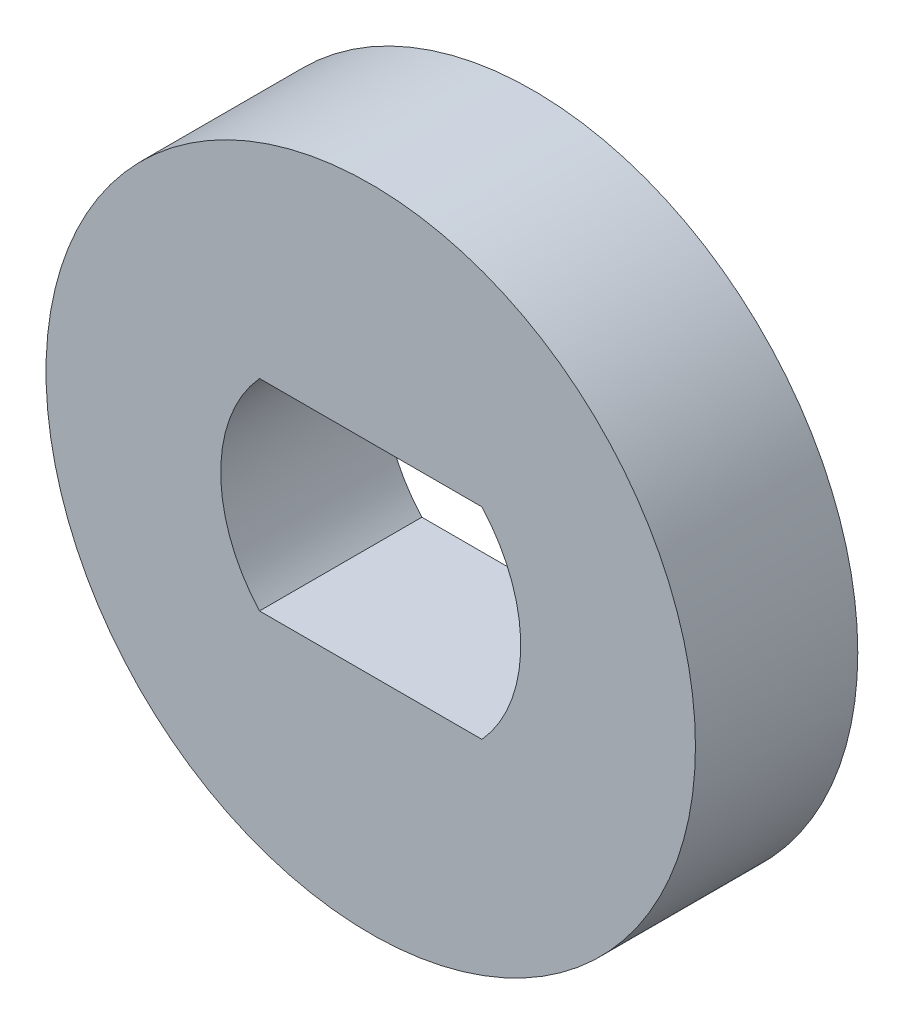
ISO-10303-21;
HEADER;
FILE_DESCRIPTION(('STEP AP214'),'2;1');
FILE_NAME('part.step','',(''),(''),'','','');
FILE_SCHEMA(('AUTOMOTIVE_DESIGN { 1 0 10303 214 1 1 1 1 }'));
ENDSEC;
DATA;
#1=APPLICATION_CONTEXT('core data for automotive mechanical design processes');
#2=APPLICATION_PROTOCOL_DEFINITION('international standard','automotive_design',2000,#1);
#3=PRODUCT_CONTEXT('',#1,'mechanical');
#4=PRODUCT('Part','Part','',(#3));
#5=PRODUCT_RELATED_PRODUCT_CATEGORY('part','',(#4));
#6=PRODUCT_DEFINITION_FORMATION('','',#4);
#7=PRODUCT_DEFINITION_CONTEXT('part definition',#1,'design');
#8=PRODUCT_DEFINITION('design','',#6,#7);
#9=PRODUCT_DEFINITION_SHAPE('','',#8);
#10=(LENGTH_UNIT() NAMED_UNIT(*) SI_UNIT(.MILLI.,.METRE.));
#11=(NAMED_UNIT(*) PLANE_ANGLE_UNIT() SI_UNIT($,.RADIAN.));
#12=(NAMED_UNIT(*) SI_UNIT($,.STERADIAN.) SOLID_ANGLE_UNIT());
#13=UNCERTAINTY_MEASURE_WITH_UNIT(LENGTH_MEASURE(1.E-05),#10,'distance_accuracy_value','');
#14=(GEOMETRIC_REPRESENTATION_CONTEXT(3) GLOBAL_UNCERTAINTY_ASSIGNED_CONTEXT((#13)) GLOBAL_UNIT_ASSIGNED_CONTEXT((#10,
#11,#12)) REPRESENTATION_CONTEXT('',''));
#15=CARTESIAN_POINT('',(0.,0.,0.));
#16=DIRECTION('',(0.,0.,1.));
#17=DIRECTION('',(1.,0.,0.));
#18=AXIS2_PLACEMENT_3D('',#15,#16,#17);
#19=CARTESIAN_POINT('',(0.,0.,3.175));
#20=DIRECTION('',(0.,0.,-1.));
#21=DIRECTION('',(-1.,0.,0.));
#22=AXIS2_PLACEMENT_3D('',#19,#20,#21);
#23=CYLINDRICAL_SURFACE('',#22,2.9337);
#24=CARTESIAN_POINT('',(0.,0.,0.));
#25=DIRECTION('',(0.,0.,1.));
#26=DIRECTION('',(1.,0.,0.));
#27=AXIS2_PLACEMENT_3D('',#24,#25,#26);
#28=CIRCLE('',#27,2.9337);
#29=CARTESIAN_POINT('',(-2.17522491710627,1.9685,0.));
#30=VERTEX_POINT('',#29);
#31=CARTESIAN_POINT('',(-2.17522491710627,-1.9685,0.));
#32=VERTEX_POINT('',#31);
#33=EDGE_CURVE('E102',#30,#32,#28,.T.);
#34=ORIENTED_EDGE('',*,*,#33,.F.);
#35=DIRECTION('',(0.,0.,-1.));
#36=VECTOR('',#35,1.);
#37=CARTESIAN_POINT('',(-2.17522491710627,1.9685,3.175));
#38=LINE('',#37,#36);
#39=CARTESIAN_POINT('',(-2.17522491710627,1.9685,3.175));
#40=VERTEX_POINT('',#39);
#41=EDGE_CURVE('E11',#40,#30,#38,.T.);
#42=ORIENTED_EDGE('',*,*,#41,.F.);
#43=CARTESIAN_POINT('',(0.,0.,3.175));
#44=DIRECTION('',(0.,0.,1.));
#45=DIRECTION('',(1.,0.,0.));
#46=AXIS2_PLACEMENT_3D('',#43,#44,#45);
#47=CIRCLE('',#46,2.9337);
#48=CARTESIAN_POINT('',(-2.17522491710627,-1.9685,3.175));
#49=VERTEX_POINT('',#48);
#50=EDGE_CURVE('E84',#40,#49,#47,.T.);
#51=ORIENTED_EDGE('',*,*,#50,.T.);
#52=DIRECTION('',(0.,0.,-1.));
#53=VECTOR('',#52,1.);
#54=CARTESIAN_POINT('',(-2.17522491710627,-1.9685,3.175));
#55=LINE('',#54,#53);
#56=EDGE_CURVE('E51',#49,#32,#55,.T.);
#57=ORIENTED_EDGE('',*,*,#56,.T.);
#58=EDGE_LOOP('',(#34,#42,#51,#57));
#59=FACE_BOUND('',#58,.T.);
#60=ADVANCED_FACE('F35',(#59),#23,.F.);
#61=CARTESIAN_POINT('',(0.,1.9685,3.175));
#62=DIRECTION('',(0.,1.,0.));
#63=DIRECTION('',(0.,0.,1.));
#64=AXIS2_PLACEMENT_3D('',#61,#62,#63);
#65=PLANE('',#64);
#66=DIRECTION('',(1.,0.,0.));
#67=VECTOR('',#66,1.);
#68=CARTESIAN_POINT('',(0.,1.9685,0.));
#69=LINE('',#68,#67);
#70=CARTESIAN_POINT('',(2.17522491710627,1.9685,0.));
#71=VERTEX_POINT('',#70);
#72=EDGE_CURVE('E90',#30,#71,#69,.T.);
#73=ORIENTED_EDGE('',*,*,#72,.T.);
#74=DIRECTION('',(0.,0.,-1.));
#75=VECTOR('',#74,1.);
#76=CARTESIAN_POINT('',(2.17522491710627,1.9685,3.175));
#77=LINE('',#76,#75);
#78=CARTESIAN_POINT('',(2.17522491710627,1.9685,3.175));
#79=VERTEX_POINT('',#78);
#80=EDGE_CURVE('E43',#79,#71,#77,.T.);
#81=ORIENTED_EDGE('',*,*,#80,.F.);
#82=DIRECTION('',(1.,0.,0.));
#83=VECTOR('',#82,1.);
#84=CARTESIAN_POINT('',(0.,1.9685,3.175));
#85=LINE('',#84,#83);
#86=EDGE_CURVE('E77',#40,#79,#85,.T.);
#87=ORIENTED_EDGE('',*,*,#86,.F.);
#88=ORIENTED_EDGE('',*,*,#41,.T.);
#89=EDGE_LOOP('',(#73,#81,#87,#88));
#90=FACE_BOUND('',#89,.T.);
#91=ADVANCED_FACE('F88',(#90),#65,.F.);
#92=CARTESIAN_POINT('',(0.,0.,3.175));
#93=DIRECTION('',(0.,0.,-1.));
#94=DIRECTION('',(-1.,0.,0.));
#95=AXIS2_PLACEMENT_3D('',#92,#93,#94);
#96=CYLINDRICAL_SURFACE('',#95,2.9337);
#97=CARTESIAN_POINT('',(0.,0.,0.));
#98=DIRECTION('',(0.,0.,1.));
#99=DIRECTION('',(1.,0.,0.));
#100=AXIS2_PLACEMENT_3D('',#97,#98,#99);
#101=CIRCLE('',#100,2.9337);
#102=CARTESIAN_POINT('',(2.17522491710627,-1.9685,0.));
#103=VERTEX_POINT('',#102);
#104=EDGE_CURVE('E105',#103,#71,#101,.T.);
#105=ORIENTED_EDGE('',*,*,#104,.F.);
#106=DIRECTION('',(0.,0.,-1.));
#107=VECTOR('',#106,1.);
#108=CARTESIAN_POINT('',(2.17522491710627,-1.9685,3.175));
#109=LINE('',#108,#107);
#110=CARTESIAN_POINT('',(2.17522491710627,-1.9685,3.175));
#111=VERTEX_POINT('',#110);
#112=EDGE_CURVE('E64',#111,#103,#109,.T.);
#113=ORIENTED_EDGE('',*,*,#112,.F.);
#114=CARTESIAN_POINT('',(0.,0.,3.175));
#115=DIRECTION('',(0.,0.,1.));
#116=DIRECTION('',(1.,0.,0.));
#117=AXIS2_PLACEMENT_3D('',#114,#115,#116);
#118=CIRCLE('',#117,2.9337);
#119=EDGE_CURVE('E83',#111,#79,#118,.T.);
#120=ORIENTED_EDGE('',*,*,#119,.T.);
#121=ORIENTED_EDGE('',*,*,#80,.T.);
#122=EDGE_LOOP('',(#105,#113,#120,#121));
#123=FACE_BOUND('',#122,.T.);
#124=ADVANCED_FACE('F93',(#123),#96,.F.);
#125=CARTESIAN_POINT('',(0.,-1.9685,3.175));
#126=DIRECTION('',(0.,1.,0.));
#127=DIRECTION('',(0.,0.,1.));
#128=AXIS2_PLACEMENT_3D('',#125,#126,#127);
#129=PLANE('',#128);
#130=DIRECTION('',(1.,0.,0.));
#131=VECTOR('',#130,1.);
#132=CARTESIAN_POINT('',(0.,-1.9685,0.));
#133=LINE('',#132,#131);
#134=EDGE_CURVE('E107',#32,#103,#133,.T.);
#135=ORIENTED_EDGE('',*,*,#134,.F.);
#136=ORIENTED_EDGE('',*,*,#56,.F.);
#137=DIRECTION('',(1.,0.,0.));
#138=VECTOR('',#137,1.);
#139=CARTESIAN_POINT('',(0.,-1.9685,3.175));
#140=LINE('',#139,#138);
#141=EDGE_CURVE('E94',#49,#111,#140,.T.);
#142=ORIENTED_EDGE('',*,*,#141,.T.);
#143=ORIENTED_EDGE('',*,*,#112,.T.);
#144=EDGE_LOOP('',(#135,#136,#142,#143));
#145=FACE_BOUND('',#144,.T.);
#146=ADVANCED_FACE('F116',(#145),#129,.T.);
#147=CARTESIAN_POINT('',(0.,0.,3.175));
#148=DIRECTION('',(0.,0.,-1.));
#149=DIRECTION('',(-1.,0.,0.));
#150=AXIS2_PLACEMENT_3D('',#147,#148,#149);
#151=CYLINDRICAL_SURFACE('',#150,6.35);
#152=CARTESIAN_POINT('',(0.,0.,3.175));
#153=DIRECTION('',(0.,0.,1.));
#154=DIRECTION('',(1.,0.,0.));
#155=AXIS2_PLACEMENT_3D('',#152,#153,#154);
#156=CIRCLE('',#155,6.35);
#157=CARTESIAN_POINT('',(6.35,0.,3.175));
#158=VERTEX_POINT('',#157);
#159=EDGE_CURVE('E96',#158,#158,#156,.T.);
#160=ORIENTED_EDGE('',*,*,#159,.F.);
#161=EDGE_LOOP('',(#160));
#162=FACE_BOUND('',#161,.T.);
#163=CARTESIAN_POINT('',(0.,0.,0.));
#164=DIRECTION('',(0.,0.,1.));
#165=DIRECTION('',(1.,0.,0.));
#166=AXIS2_PLACEMENT_3D('',#163,#164,#165);
#167=CIRCLE('',#166,6.35);
#168=CARTESIAN_POINT('',(6.35,0.,0.));
#169=VERTEX_POINT('',#168);
#170=EDGE_CURVE('E110',#169,#169,#167,.T.);
#171=ORIENTED_EDGE('',*,*,#170,.T.);
#172=EDGE_LOOP('',(#171));
#173=FACE_BOUND('',#172,.T.);
#174=ADVANCED_FACE('F118',(#162,#173),#151,.T.);
#175=CARTESIAN_POINT('',(0.,0.,3.175));
#176=DIRECTION('',(0.,0.,1.));
#177=DIRECTION('',(1.,0.,0.));
#178=AXIS2_PLACEMENT_3D('',#175,#176,#177);
#179=PLANE('',#178);
#180=ORIENTED_EDGE('',*,*,#50,.F.);
#181=ORIENTED_EDGE('',*,*,#86,.T.);
#182=ORIENTED_EDGE('',*,*,#119,.F.);
#183=ORIENTED_EDGE('',*,*,#141,.F.);
#184=EDGE_LOOP('',(#180,#181,#182,#183));
#185=FACE_BOUND('',#184,.T.);
#186=ORIENTED_EDGE('',*,*,#159,.T.);
#187=EDGE_LOOP('',(#186));
#188=FACE_BOUND('',#187,.T.);
#189=ADVANCED_FACE('F79',(#185,#188),#179,.T.);
#190=CARTESIAN_POINT('',(0.,0.,0.));
#191=DIRECTION('',(0.,0.,1.));
#192=DIRECTION('',(1.,0.,0.));
#193=AXIS2_PLACEMENT_3D('',#190,#191,#192);
#194=PLANE('',#193);
#195=ORIENTED_EDGE('',*,*,#33,.T.);
#196=ORIENTED_EDGE('',*,*,#134,.T.);
#197=ORIENTED_EDGE('',*,*,#104,.T.);
#198=ORIENTED_EDGE('',*,*,#72,.F.);
#199=EDGE_LOOP('',(#195,#196,#197,#198));
#200=FACE_BOUND('',#199,.T.);
#201=ORIENTED_EDGE('',*,*,#170,.F.);
#202=EDGE_LOOP('',(#201));
#203=FACE_BOUND('',#202,.T.);
#204=ADVANCED_FACE('F156',(#200,#203),#194,.F.);
#205=CLOSED_SHELL('',(#60,#91,#124,#146,#174,#189,#204));
#206=MANIFOLD_SOLID_BREP('B2',#205);
#207=ADVANCED_BREP_SHAPE_REPRESENTATION('',(#18,#206),#14);
#208=SHAPE_DEFINITION_REPRESENTATION(#9,#207);
ENDSEC;
END-ISO-10303-21;
